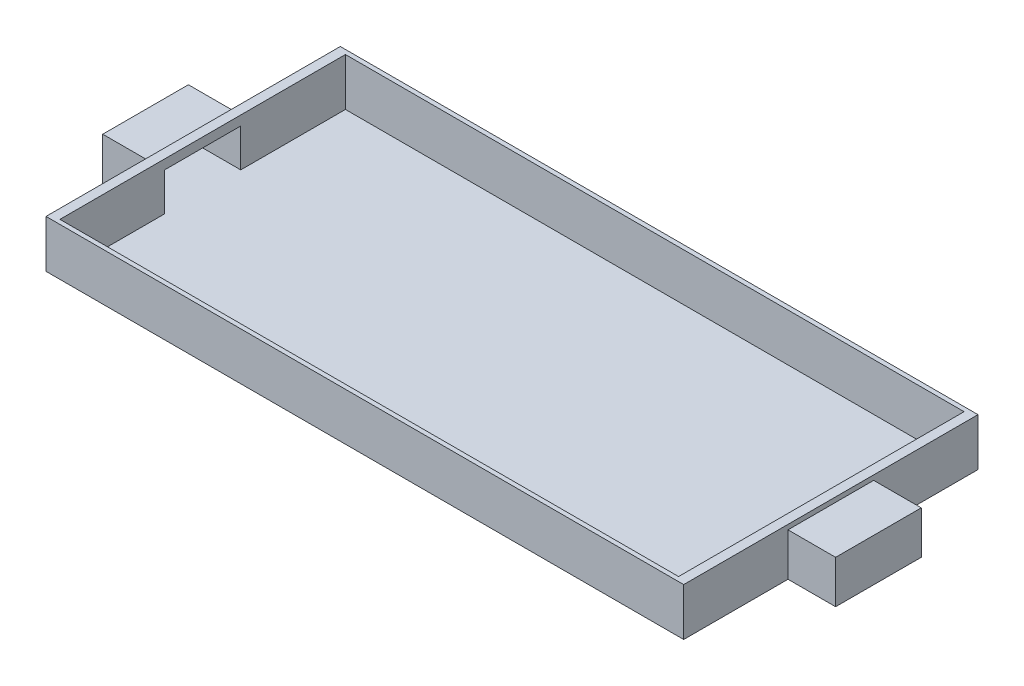
ISO-10303-21;
HEADER;
FILE_DESCRIPTION(('STEP AP214'),'2;1');
FILE_NAME('part.step','',(''),(''),'','','');
FILE_SCHEMA(('AUTOMOTIVE_DESIGN { 1 0 10303 214 1 1 1 1 }'));
ENDSEC;
DATA;
#1=APPLICATION_CONTEXT('core data for automotive mechanical design processes');
#2=APPLICATION_PROTOCOL_DEFINITION('international standard','automotive_design',2000,#1);
#3=PRODUCT_CONTEXT('',#1,'mechanical');
#4=PRODUCT('Part','Part','',(#3));
#5=PRODUCT_RELATED_PRODUCT_CATEGORY('part','',(#4));
#6=PRODUCT_DEFINITION_FORMATION('','',#4);
#7=PRODUCT_DEFINITION_CONTEXT('part definition',#1,'design');
#8=PRODUCT_DEFINITION('design','',#6,#7);
#9=PRODUCT_DEFINITION_SHAPE('','',#8);
#10=(LENGTH_UNIT() NAMED_UNIT(*) SI_UNIT(.MILLI.,.METRE.));
#11=(NAMED_UNIT(*) PLANE_ANGLE_UNIT() SI_UNIT($,.RADIAN.));
#12=(NAMED_UNIT(*) SI_UNIT($,.STERADIAN.) SOLID_ANGLE_UNIT());
#13=UNCERTAINTY_MEASURE_WITH_UNIT(LENGTH_MEASURE(1.E-05),#10,'distance_accuracy_value','');
#14=(GEOMETRIC_REPRESENTATION_CONTEXT(3) GLOBAL_UNCERTAINTY_ASSIGNED_CONTEXT((#13)) GLOBAL_UNIT_ASSIGNED_CONTEXT((#10,
#11,#12)) REPRESENTATION_CONTEXT('',''));
#15=CARTESIAN_POINT('',(0.,0.,0.));
#16=DIRECTION('',(0.,0.,1.));
#17=DIRECTION('',(1.,0.,0.));
#18=AXIS2_PLACEMENT_3D('',#15,#16,#17);
#19=CARTESIAN_POINT('',(0.,0.,0.));
#20=DIRECTION('',(0.,1.,0.));
#21=DIRECTION('',(0.,0.,1.));
#22=AXIS2_PLACEMENT_3D('',#19,#20,#21);
#23=PLANE('',#22);
#24=DIRECTION('',(-1.,0.,0.));
#25=VECTOR('',#24,1.);
#26=CARTESIAN_POINT('',(-3.25,0.,-1.5));
#27=LINE('',#26,#25);
#28=CARTESIAN_POINT('',(3.25,0.,-1.5));
#29=VERTEX_POINT('',#28);
#30=CARTESIAN_POINT('',(-3.25,0.,-1.5));
#31=VERTEX_POINT('',#30);
#32=EDGE_CURVE('E90',#29,#31,#27,.T.);
#33=ORIENTED_EDGE('',*,*,#32,.F.);
#34=DIRECTION('',(0.,0.,-1.));
#35=VECTOR('',#34,1.);
#36=CARTESIAN_POINT('',(3.25,0.,-1.5));
#37=LINE('',#36,#35);
#38=CARTESIAN_POINT('',(3.25,0.,-0.399999999999998));
#39=VERTEX_POINT('',#38);
#40=EDGE_CURVE('E12',#39,#29,#37,.T.);
#41=ORIENTED_EDGE('',*,*,#40,.F.);
#42=DIRECTION('',(1.,0.,0.));
#43=VECTOR('',#42,1.);
#44=CARTESIAN_POINT('',(-3.350012,0.,-0.400000000000002));
#45=LINE('',#44,#43);
#46=CARTESIAN_POINT('',(3.8,0.,-0.400000000000002));
#47=VERTEX_POINT('',#46);
#48=EDGE_CURVE('E50',#39,#47,#45,.T.);
#49=ORIENTED_EDGE('',*,*,#48,.T.);
#50=DIRECTION('',(0.,0.,-1.));
#51=VECTOR('',#50,1.);
#52=CARTESIAN_POINT('',(3.8,0.,0.399999999999998));
#53=LINE('',#52,#51);
#54=CARTESIAN_POINT('',(3.8,0.,0.399999999999998));
#55=VERTEX_POINT('',#54);
#56=EDGE_CURVE('E120',#55,#47,#53,.T.);
#57=ORIENTED_EDGE('',*,*,#56,.F.);
#58=DIRECTION('',(1.,0.,0.));
#59=VECTOR('',#58,1.);
#60=CARTESIAN_POINT('',(-3.350012,0.,0.399999999999998));
#61=LINE('',#60,#59);
#62=CARTESIAN_POINT('',(3.25,0.,0.400000000000002));
#63=VERTEX_POINT('',#62);
#64=EDGE_CURVE('E117',#63,#55,#61,.T.);
#65=ORIENTED_EDGE('',*,*,#64,.F.);
#66=DIRECTION('',(0.,0.,-1.));
#67=VECTOR('',#66,1.);
#68=CARTESIAN_POINT('',(3.25,0.,-1.5));
#69=LINE('',#68,#67);
#70=CARTESIAN_POINT('',(3.25,0.,1.5));
#71=VERTEX_POINT('',#70);
#72=EDGE_CURVE('E114',#71,#63,#69,.T.);
#73=ORIENTED_EDGE('',*,*,#72,.F.);
#74=DIRECTION('',(1.,0.,0.));
#75=VECTOR('',#74,1.);
#76=CARTESIAN_POINT('',(-3.25,0.,1.5));
#77=LINE('',#76,#75);
#78=CARTESIAN_POINT('',(-3.25,0.,1.5));
#79=VERTEX_POINT('',#78);
#80=EDGE_CURVE('E111',#79,#71,#77,.T.);
#81=ORIENTED_EDGE('',*,*,#80,.F.);
#82=DIRECTION('',(0.,0.,1.));
#83=VECTOR('',#82,1.);
#84=CARTESIAN_POINT('',(-3.25,0.,-1.5));
#85=LINE('',#84,#83);
#86=CARTESIAN_POINT('',(-3.25,0.,0.399999999999998));
#87=VERTEX_POINT('',#86);
#88=EDGE_CURVE('E108',#87,#79,#85,.T.);
#89=ORIENTED_EDGE('',*,*,#88,.F.);
#90=DIRECTION('',(1.,0.,0.));
#91=VECTOR('',#90,1.);
#92=CARTESIAN_POINT('',(-3.350012,0.,0.399999999999998));
#93=LINE('',#92,#91);
#94=CARTESIAN_POINT('',(-3.8,0.,0.399999999999998));
#95=VERTEX_POINT('',#94);
#96=EDGE_CURVE('E105',#95,#87,#93,.T.);
#97=ORIENTED_EDGE('',*,*,#96,.F.);
#98=DIRECTION('',(0.,0.,-1.));
#99=VECTOR('',#98,1.);
#100=CARTESIAN_POINT('',(-3.8,0.,0.399999999999998));
#101=LINE('',#100,#99);
#102=CARTESIAN_POINT('',(-3.8,0.,-0.400000000000002));
#103=VERTEX_POINT('',#102);
#104=EDGE_CURVE('E102',#95,#103,#101,.T.);
#105=ORIENTED_EDGE('',*,*,#104,.T.);
#106=DIRECTION('',(1.,0.,0.));
#107=VECTOR('',#106,1.);
#108=CARTESIAN_POINT('',(-3.350012,0.,-0.400000000000002));
#109=LINE('',#108,#107);
#110=CARTESIAN_POINT('',(-3.25,0.,-0.400000000000002));
#111=VERTEX_POINT('',#110);
#112=EDGE_CURVE('E92',#103,#111,#109,.T.);
#113=ORIENTED_EDGE('',*,*,#112,.T.);
#114=DIRECTION('',(0.,0.,1.));
#115=VECTOR('',#114,1.);
#116=CARTESIAN_POINT('',(-3.25,0.,-1.5));
#117=LINE('',#116,#115);
#118=EDGE_CURVE('E88',#31,#111,#117,.T.);
#119=ORIENTED_EDGE('',*,*,#118,.F.);
#120=EDGE_LOOP('',(#33,#41,#49,#57,#65,#73,#81,#89,#97,#105,#113,#119));
#121=FACE_BOUND('',#120,.T.);
#122=ADVANCED_FACE('F45',(#121),#23,.F.);
#123=OPEN_SHELL('',(#122));
#124=SHELL_BASED_SURFACE_MODEL('B2',(#123));
#125=CARTESIAN_POINT('',(0.,0.,0.));
#126=DIRECTION('',(0.,1.,0.));
#127=DIRECTION('',(0.,0.,1.));
#128=AXIS2_PLACEMENT_3D('',#125,#126,#127);
#129=PLANE('',#128);
#130=DIRECTION('',(0.,0.,-1.));
#131=VECTOR('',#130,1.);
#132=CARTESIAN_POINT('',(3.35,0.,-1.54615384615385));
#133=LINE('',#132,#131);
#134=CARTESIAN_POINT('',(3.35,0.,-0.450000000000002));
#135=VERTEX_POINT('',#134);
#136=CARTESIAN_POINT('',(3.35,0.,-1.54615384615385));
#137=VERTEX_POINT('',#136);
#138=EDGE_CURVE('E466',#135,#137,#133,.T.);
#139=ORIENTED_EDGE('',*,*,#138,.F.);
#140=DIRECTION('',(-1.,0.,0.));
#141=VECTOR('',#140,1.);
#142=CARTESIAN_POINT('',(3.85,0.,-0.450000000000002));
#143=LINE('',#142,#141);
#144=CARTESIAN_POINT('',(3.85,0.,-0.450000000000002));
#145=VERTEX_POINT('',#144);
#146=EDGE_CURVE('E176',#145,#135,#143,.T.);
#147=ORIENTED_EDGE('',*,*,#146,.F.);
#148=DIRECTION('',(0.,0.,1.));
#149=VECTOR('',#148,1.);
#150=CARTESIAN_POINT('',(3.85,0.,0.449999999999998));
#151=LINE('',#150,#149);
#152=CARTESIAN_POINT('',(3.85,0.,0.449999999999998));
#153=VERTEX_POINT('',#152);
#154=EDGE_CURVE('E355',#145,#153,#151,.T.);
#155=ORIENTED_EDGE('',*,*,#154,.T.);
#156=DIRECTION('',(-1.,0.,0.));
#157=VECTOR('',#156,1.);
#158=CARTESIAN_POINT('',(3.85,0.,0.449999999999998));
#159=LINE('',#158,#157);
#160=CARTESIAN_POINT('',(3.35,0.,0.449999999999998));
#161=VERTEX_POINT('',#160);
#162=EDGE_CURVE('E367',#153,#161,#159,.T.);
#163=ORIENTED_EDGE('',*,*,#162,.T.);
#164=CARTESIAN_POINT('',(3.35,0.,1.54615384615384));
#165=VERTEX_POINT('',#164);
#166=EDGE_CURVE('E478',#165,#161,#133,.T.);
#167=ORIENTED_EDGE('',*,*,#166,.F.);
#168=DIRECTION('',(1.,0.,0.));
#169=VECTOR('',#168,1.);
#170=CARTESIAN_POINT('',(-3.35,0.,1.54615384615384));
#171=LINE('',#170,#169);
#172=CARTESIAN_POINT('',(-3.35,0.,1.54615384615384));
#173=VERTEX_POINT('',#172);
#174=EDGE_CURVE('E471',#173,#165,#171,.T.);
#175=ORIENTED_EDGE('',*,*,#174,.F.);
#176=DIRECTION('',(0.,0.,1.));
#177=VECTOR('',#176,1.);
#178=CARTESIAN_POINT('',(-3.35,0.,-1.54615384615385));
#179=LINE('',#178,#177);
#180=CARTESIAN_POINT('',(-3.35,0.,0.449999999999998));
#181=VERTEX_POINT('',#180);
#182=EDGE_CURVE('E483',#181,#173,#179,.T.);
#183=ORIENTED_EDGE('',*,*,#182,.F.);
#184=DIRECTION('',(1.,0.,0.));
#185=VECTOR('',#184,1.);
#186=CARTESIAN_POINT('',(-3.85,0.,0.449999999999998));
#187=LINE('',#186,#185);
#188=CARTESIAN_POINT('',(-3.85,0.,0.449999999999998));
#189=VERTEX_POINT('',#188);
#190=EDGE_CURVE('E416',#189,#181,#187,.T.);
#191=ORIENTED_EDGE('',*,*,#190,.F.);
#192=DIRECTION('',(0.,0.,1.));
#193=VECTOR('',#192,1.);
#194=CARTESIAN_POINT('',(-3.85,0.,0.449999999999998));
#195=LINE('',#194,#193);
#196=CARTESIAN_POINT('',(-3.85,0.,-0.450000000000002));
#197=VERTEX_POINT('',#196);
#198=EDGE_CURVE('E393',#197,#189,#195,.T.);
#199=ORIENTED_EDGE('',*,*,#198,.F.);
#200=DIRECTION('',(1.,0.,0.));
#201=VECTOR('',#200,1.);
#202=CARTESIAN_POINT('',(-3.85,0.,-0.450000000000002));
#203=LINE('',#202,#201);
#204=CARTESIAN_POINT('',(-3.35,0.,-0.450000000000002));
#205=VERTEX_POINT('',#204);
#206=EDGE_CURVE('E402',#197,#205,#203,.T.);
#207=ORIENTED_EDGE('',*,*,#206,.T.);
#208=CARTESIAN_POINT('',(-3.35,0.,-1.54615384615385));
#209=VERTEX_POINT('',#208);
#210=EDGE_CURVE('E484',#209,#205,#179,.T.);
#211=ORIENTED_EDGE('',*,*,#210,.F.);
#212=DIRECTION('',(-1.,0.,0.));
#213=VECTOR('',#212,1.);
#214=CARTESIAN_POINT('',(-3.35,0.,-1.54615384615385));
#215=LINE('',#214,#213);
#216=EDGE_CURVE('E481',#137,#209,#215,.T.);
#217=ORIENTED_EDGE('',*,*,#216,.F.);
#218=EDGE_LOOP('',(#139,#147,#155,#163,#167,#175,#183,#191,#199,#207,#211,#217));
#219=FACE_BOUND('',#218,.T.);
#220=DIRECTION('',(1.,0.,0.));
#221=VECTOR('',#220,1.);
#222=CARTESIAN_POINT('',(-3.350012,0.,0.399999999999998));
#223=LINE('',#222,#221);
#224=CARTESIAN_POINT('',(3.25,0.,0.400000000000002));
#225=VERTEX_POINT('',#224);
#226=CARTESIAN_POINT('',(3.8,0.,0.399999999999998));
#227=VERTEX_POINT('',#226);
#228=EDGE_CURVE('E419',#225,#227,#223,.T.);
#229=ORIENTED_EDGE('',*,*,#228,.T.);
#230=DIRECTION('',(0.,0.,-1.));
#231=VECTOR('',#230,1.);
#232=CARTESIAN_POINT('',(3.8,0.,0.399999999999998));
#233=LINE('',#232,#231);
#234=CARTESIAN_POINT('',(3.8,0.,-0.400000000000002));
#235=VERTEX_POINT('',#234);
#236=EDGE_CURVE('E344',#227,#235,#233,.T.);
#237=ORIENTED_EDGE('',*,*,#236,.T.);
#238=DIRECTION('',(1.,0.,0.));
#239=VECTOR('',#238,1.);
#240=CARTESIAN_POINT('',(-3.350012,0.,-0.400000000000002));
#241=LINE('',#240,#239);
#242=CARTESIAN_POINT('',(3.25,0.,-0.399999999999998));
#243=VERTEX_POINT('',#242);
#244=EDGE_CURVE('E340',#243,#235,#241,.T.);
#245=ORIENTED_EDGE('',*,*,#244,.F.);
#246=DIRECTION('',(0.,0.,-1.));
#247=VECTOR('',#246,1.);
#248=CARTESIAN_POINT('',(3.25,0.,-1.5));
#249=LINE('',#248,#247);
#250=CARTESIAN_POINT('',(3.25,0.,-1.5));
#251=VERTEX_POINT('',#250);
#252=EDGE_CURVE('E432',#243,#251,#249,.T.);
#253=ORIENTED_EDGE('',*,*,#252,.T.);
#254=DIRECTION('',(-1.,0.,0.));
#255=VECTOR('',#254,1.);
#256=CARTESIAN_POINT('',(-3.25,0.,-1.5));
#257=LINE('',#256,#255);
#258=CARTESIAN_POINT('',(-3.25,0.,-1.5));
#259=VERTEX_POINT('',#258);
#260=EDGE_CURVE('E447',#251,#259,#257,.T.);
#261=ORIENTED_EDGE('',*,*,#260,.T.);
#262=DIRECTION('',(0.,0.,1.));
#263=VECTOR('',#262,1.);
#264=CARTESIAN_POINT('',(-3.25,0.,-1.5));
#265=LINE('',#264,#263);
#266=CARTESIAN_POINT('',(-3.25,0.,-0.400000000000002));
#267=VERTEX_POINT('',#266);
#268=EDGE_CURVE('E451',#259,#267,#265,.T.);
#269=ORIENTED_EDGE('',*,*,#268,.T.);
#270=CARTESIAN_POINT('',(-3.8,0.,-0.400000000000002));
#271=VERTEX_POINT('',#270);
#272=EDGE_CURVE('E334',#271,#267,#241,.T.);
#273=ORIENTED_EDGE('',*,*,#272,.F.);
#274=DIRECTION('',(0.,0.,-1.));
#275=VECTOR('',#274,1.);
#276=CARTESIAN_POINT('',(-3.8,0.,0.399999999999998));
#277=LINE('',#276,#275);
#278=CARTESIAN_POINT('',(-3.8,0.,0.399999999999998));
#279=VERTEX_POINT('',#278);
#280=EDGE_CURVE('E386',#279,#271,#277,.T.);
#281=ORIENTED_EDGE('',*,*,#280,.F.);
#282=CARTESIAN_POINT('',(-3.25,0.,0.399999999999998));
#283=VERTEX_POINT('',#282);
#284=EDGE_CURVE('E421',#279,#283,#223,.T.);
#285=ORIENTED_EDGE('',*,*,#284,.T.);
#286=CARTESIAN_POINT('',(-3.25,0.,1.5));
#287=VERTEX_POINT('',#286);
#288=EDGE_CURVE('E450',#283,#287,#265,.T.);
#289=ORIENTED_EDGE('',*,*,#288,.T.);
#290=DIRECTION('',(1.,0.,0.));
#291=VECTOR('',#290,1.);
#292=CARTESIAN_POINT('',(-3.25,0.,1.5));
#293=LINE('',#292,#291);
#294=CARTESIAN_POINT('',(3.25,0.,1.5));
#295=VERTEX_POINT('',#294);
#296=EDGE_CURVE('E436',#287,#295,#293,.T.);
#297=ORIENTED_EDGE('',*,*,#296,.T.);
#298=EDGE_CURVE('E444',#295,#225,#249,.T.);
#299=ORIENTED_EDGE('',*,*,#298,.T.);
#300=EDGE_LOOP('',(#229,#237,#245,#253,#261,#269,#273,#281,#285,#289,#297,#299));
#301=FACE_BOUND('',#300,.T.);
#302=ADVANCED_FACE('F161',(#219,#301),#129,.F.);
#303=CARTESIAN_POINT('',(-3.35,0.5,-1.54615384615385));
#304=DIRECTION('',(1.,0.,0.));
#305=DIRECTION('',(0.,0.,-1.));
#306=AXIS2_PLACEMENT_3D('',#303,#304,#305);
#307=PLANE('',#306);
#308=DIRECTION('',(0.,-1.,0.));
#309=VECTOR('',#308,1.);
#310=CARTESIAN_POINT('',(-3.35,0.,-0.450000000000002));
#311=LINE('',#310,#309);
#312=CARTESIAN_POINT('',(-3.35,0.45,-0.450000000000002));
#313=VERTEX_POINT('',#312);
#314=EDGE_CURVE('E184',#313,#205,#311,.T.);
#315=ORIENTED_EDGE('',*,*,#314,.F.);
#316=DIRECTION('',(0.,0.,-1.));
#317=VECTOR('',#316,1.);
#318=CARTESIAN_POINT('',(-3.35,0.45,-0.450000000000002));
#319=LINE('',#318,#317);
#320=CARTESIAN_POINT('',(-3.35,0.45,0.449999999999998));
#321=VERTEX_POINT('',#320);
#322=EDGE_CURVE('E405',#321,#313,#319,.T.);
#323=ORIENTED_EDGE('',*,*,#322,.F.);
#324=DIRECTION('',(0.,1.,0.));
#325=VECTOR('',#324,1.);
#326=CARTESIAN_POINT('',(-3.35,0.45,0.449999999999998));
#327=LINE('',#326,#325);
#328=EDGE_CURVE('E392',#181,#321,#327,.T.);
#329=ORIENTED_EDGE('',*,*,#328,.F.);
#330=ORIENTED_EDGE('',*,*,#182,.T.);
#331=DIRECTION('',(0.,-1.,0.));
#332=VECTOR('',#331,1.);
#333=CARTESIAN_POINT('',(-3.35,0.5,1.54615384615384));
#334=LINE('',#333,#332);
#335=CARTESIAN_POINT('',(-3.35,0.5,1.54615384615384));
#336=VERTEX_POINT('',#335);
#337=EDGE_CURVE('E489',#336,#173,#334,.T.);
#338=ORIENTED_EDGE('',*,*,#337,.F.);
#339=DIRECTION('',(0.,0.,1.));
#340=VECTOR('',#339,1.);
#341=CARTESIAN_POINT('',(-3.35,0.5,-1.54615384615385));
#342=LINE('',#341,#340);
#343=CARTESIAN_POINT('',(-3.35,0.5,-1.54615384615385));
#344=VERTEX_POINT('',#343);
#345=EDGE_CURVE('E473',#344,#336,#342,.T.);
#346=ORIENTED_EDGE('',*,*,#345,.F.);
#347=DIRECTION('',(0.,-1.,0.));
#348=VECTOR('',#347,1.);
#349=CARTESIAN_POINT('',(-3.35,0.5,-1.54615384615385));
#350=LINE('',#349,#348);
#351=EDGE_CURVE('E492',#344,#209,#350,.T.);
#352=ORIENTED_EDGE('',*,*,#351,.T.);
#353=ORIENTED_EDGE('',*,*,#210,.T.);
#354=EDGE_LOOP('',(#315,#323,#329,#330,#338,#346,#352,#353));
#355=FACE_BOUND('',#354,.T.);
#356=ADVANCED_FACE('F555',(#355),#307,.F.);
#357=CARTESIAN_POINT('',(3.35,0.5,-1.54615384615385));
#358=DIRECTION('',(-1.,0.,0.));
#359=DIRECTION('',(0.,0.,1.));
#360=AXIS2_PLACEMENT_3D('',#357,#358,#359);
#361=PLANE('',#360);
#362=ORIENTED_EDGE('',*,*,#166,.T.);
#363=DIRECTION('',(0.,1.,0.));
#364=VECTOR('',#363,1.);
#365=CARTESIAN_POINT('',(3.35,0.45,0.449999999999998));
#366=LINE('',#365,#364);
#367=CARTESIAN_POINT('',(3.35,0.45,0.449999999999998));
#368=VERTEX_POINT('',#367);
#369=EDGE_CURVE('E359',#161,#368,#366,.T.);
#370=ORIENTED_EDGE('',*,*,#369,.T.);
#371=DIRECTION('',(0.,0.,-1.));
#372=VECTOR('',#371,1.);
#373=CARTESIAN_POINT('',(3.35,0.45,-0.450000000000002));
#374=LINE('',#373,#372);
#375=CARTESIAN_POINT('',(3.35,0.45,-0.450000000000002));
#376=VERTEX_POINT('',#375);
#377=EDGE_CURVE('E369',#368,#376,#374,.T.);
#378=ORIENTED_EDGE('',*,*,#377,.T.);
#379=DIRECTION('',(0.,-1.,0.));
#380=VECTOR('',#379,1.);
#381=CARTESIAN_POINT('',(3.35,0.,-0.450000000000002));
#382=LINE('',#381,#380);
#383=EDGE_CURVE('E354',#376,#135,#382,.T.);
#384=ORIENTED_EDGE('',*,*,#383,.T.);
#385=ORIENTED_EDGE('',*,*,#138,.T.);
#386=DIRECTION('',(0.,-1.,0.));
#387=VECTOR('',#386,1.);
#388=CARTESIAN_POINT('',(3.35,0.5,-1.54615384615385));
#389=LINE('',#388,#387);
#390=CARTESIAN_POINT('',(3.35,0.5,-1.54615384615385));
#391=VERTEX_POINT('',#390);
#392=EDGE_CURVE('E495',#391,#137,#389,.T.);
#393=ORIENTED_EDGE('',*,*,#392,.F.);
#394=DIRECTION('',(0.,0.,-1.));
#395=VECTOR('',#394,1.);
#396=CARTESIAN_POINT('',(3.35,0.5,-1.54615384615385));
#397=LINE('',#396,#395);
#398=CARTESIAN_POINT('',(3.35,0.5,1.54615384615384));
#399=VERTEX_POINT('',#398);
#400=EDGE_CURVE('E467',#399,#391,#397,.T.);
#401=ORIENTED_EDGE('',*,*,#400,.F.);
#402=DIRECTION('',(0.,-1.,0.));
#403=VECTOR('',#402,1.);
#404=CARTESIAN_POINT('',(3.35,0.5,1.54615384615384));
#405=LINE('',#404,#403);
#406=EDGE_CURVE('E477',#399,#165,#405,.T.);
#407=ORIENTED_EDGE('',*,*,#406,.T.);
#408=EDGE_LOOP('',(#362,#370,#378,#384,#385,#393,#401,#407));
#409=FACE_BOUND('',#408,.T.);
#410=ADVANCED_FACE('F163',(#409),#361,.F.);
#411=CARTESIAN_POINT('',(3.25,0.5,-1.5));
#412=DIRECTION('',(-1.,0.,0.));
#413=DIRECTION('',(0.,0.,1.));
#414=AXIS2_PLACEMENT_3D('',#411,#412,#413);
#415=PLANE('',#414);
#416=DIRECTION('',(0.,0.,1.));
#417=VECTOR('',#416,1.);
#418=CARTESIAN_POINT('',(3.25,0.4,-1.5));
#419=LINE('',#418,#417);
#420=CARTESIAN_POINT('',(3.25,0.4,-0.399999999999998));
#421=VERTEX_POINT('',#420);
#422=CARTESIAN_POINT('',(3.25,0.4,0.400000000000002));
#423=VERTEX_POINT('',#422);
#424=EDGE_CURVE('E330',#421,#423,#419,.T.);
#425=ORIENTED_EDGE('',*,*,#424,.T.);
#426=DIRECTION('',(0.,-1.,0.));
#427=VECTOR('',#426,1.);
#428=CARTESIAN_POINT('',(3.25,0.500000000000001,0.400000000000002));
#429=LINE('',#428,#427);
#430=EDGE_CURVE('E429',#423,#225,#429,.T.);
#431=ORIENTED_EDGE('',*,*,#430,.T.);
#432=ORIENTED_EDGE('',*,*,#298,.F.);
#433=DIRECTION('',(0.,-1.,0.));
#434=VECTOR('',#433,1.);
#435=CARTESIAN_POINT('',(3.25,0.5,1.5));
#436=LINE('',#435,#434);
#437=CARTESIAN_POINT('',(3.25,0.5,1.5));
#438=VERTEX_POINT('',#437);
#439=EDGE_CURVE('E443',#438,#295,#436,.T.);
#440=ORIENTED_EDGE('',*,*,#439,.F.);
#441=DIRECTION('',(0.,0.,-1.));
#442=VECTOR('',#441,1.);
#443=CARTESIAN_POINT('',(3.25,0.5,-1.5));
#444=LINE('',#443,#442);
#445=CARTESIAN_POINT('',(3.25,0.5,-1.5));
#446=VERTEX_POINT('',#445);
#447=EDGE_CURVE('E433',#438,#446,#444,.T.);
#448=ORIENTED_EDGE('',*,*,#447,.T.);
#449=DIRECTION('',(0.,-1.,0.));
#450=VECTOR('',#449,1.);
#451=CARTESIAN_POINT('',(3.25,0.5,-1.5));
#452=LINE('',#451,#450);
#453=EDGE_CURVE('E463',#446,#251,#452,.T.);
#454=ORIENTED_EDGE('',*,*,#453,.T.);
#455=ORIENTED_EDGE('',*,*,#252,.F.);
#456=DIRECTION('',(0.,1.,0.));
#457=VECTOR('',#456,1.);
#458=CARTESIAN_POINT('',(3.25,0.5,-0.399999999999998));
#459=LINE('',#458,#457);
#460=EDGE_CURVE('E426',#243,#421,#459,.T.);
#461=ORIENTED_EDGE('',*,*,#460,.T.);
#462=EDGE_LOOP('',(#425,#431,#432,#440,#448,#454,#455,#461));
#463=FACE_BOUND('',#462,.T.);
#464=ADVANCED_FACE('F535',(#463),#415,.T.);
#465=CARTESIAN_POINT('',(-3.25,0.5,-1.5));
#466=DIRECTION('',(1.,0.,0.));
#467=DIRECTION('',(0.,0.,-1.));
#468=AXIS2_PLACEMENT_3D('',#465,#466,#467);
#469=PLANE('',#468);
#470=ORIENTED_EDGE('',*,*,#288,.F.);
#471=DIRECTION('',(0.,1.,0.));
#472=VECTOR('',#471,1.);
#473=CARTESIAN_POINT('',(-3.25,0.500000000000001,0.399999999999998));
#474=LINE('',#473,#472);
#475=CARTESIAN_POINT('',(-3.25,0.4,0.399999999999998));
#476=VERTEX_POINT('',#475);
#477=EDGE_CURVE('E43',#283,#476,#474,.T.);
#478=ORIENTED_EDGE('',*,*,#477,.T.);
#479=DIRECTION('',(0.,0.,-1.));
#480=VECTOR('',#479,1.);
#481=CARTESIAN_POINT('',(-3.25,0.4,-1.5));
#482=LINE('',#481,#480);
#483=CARTESIAN_POINT('',(-3.25,0.4,-0.400000000000002));
#484=VERTEX_POINT('',#483);
#485=EDGE_CURVE('E169',#476,#484,#482,.T.);
#486=ORIENTED_EDGE('',*,*,#485,.T.);
#487=DIRECTION('',(0.,-1.,0.));
#488=VECTOR('',#487,1.);
#489=CARTESIAN_POINT('',(-3.25,0.5,-0.400000000000002));
#490=LINE('',#489,#488);
#491=EDGE_CURVE('E498',#484,#267,#490,.T.);
#492=ORIENTED_EDGE('',*,*,#491,.T.);
#493=ORIENTED_EDGE('',*,*,#268,.F.);
#494=DIRECTION('',(0.,-1.,0.));
#495=VECTOR('',#494,1.);
#496=CARTESIAN_POINT('',(-3.25,0.5,-1.5));
#497=LINE('',#496,#495);
#498=CARTESIAN_POINT('',(-3.25,0.5,-1.5));
#499=VERTEX_POINT('',#498);
#500=EDGE_CURVE('E461',#499,#259,#497,.T.);
#501=ORIENTED_EDGE('',*,*,#500,.F.);
#502=DIRECTION('',(0.,0.,1.));
#503=VECTOR('',#502,1.);
#504=CARTESIAN_POINT('',(-3.25,0.5,-1.5));
#505=LINE('',#504,#503);
#506=CARTESIAN_POINT('',(-3.25,0.5,1.5));
#507=VERTEX_POINT('',#506);
#508=EDGE_CURVE('E438',#499,#507,#505,.T.);
#509=ORIENTED_EDGE('',*,*,#508,.T.);
#510=DIRECTION('',(0.,-1.,0.));
#511=VECTOR('',#510,1.);
#512=CARTESIAN_POINT('',(-3.25,0.5,1.5));
#513=LINE('',#512,#511);
#514=EDGE_CURVE('E458',#507,#287,#513,.T.);
#515=ORIENTED_EDGE('',*,*,#514,.T.);
#516=EDGE_LOOP('',(#470,#478,#486,#492,#493,#501,#509,#515));
#517=FACE_BOUND('',#516,.T.);
#518=ADVANCED_FACE('F503',(#517),#469,.T.);
#519=CARTESIAN_POINT('',(0.,0.5,0.));
#520=DIRECTION('',(0.,1.,0.));
#521=DIRECTION('',(0.,0.,1.));
#522=AXIS2_PLACEMENT_3D('',#519,#520,#521);
#523=PLANE('',#522);
#524=ORIENTED_EDGE('',*,*,#400,.T.);
#525=DIRECTION('',(-1.,0.,0.));
#526=VECTOR('',#525,1.);
#527=CARTESIAN_POINT('',(-3.35,0.5,-1.54615384615385));
#528=LINE('',#527,#526);
#529=EDGE_CURVE('E470',#391,#344,#528,.T.);
#530=ORIENTED_EDGE('',*,*,#529,.T.);
#531=ORIENTED_EDGE('',*,*,#345,.T.);
#532=DIRECTION('',(1.,0.,0.));
#533=VECTOR('',#532,1.);
#534=CARTESIAN_POINT('',(-3.35,0.5,1.54615384615384));
#535=LINE('',#534,#533);
#536=EDGE_CURVE('E475',#336,#399,#535,.T.);
#537=ORIENTED_EDGE('',*,*,#536,.T.);
#538=EDGE_LOOP('',(#524,#530,#531,#537));
#539=FACE_BOUND('',#538,.T.);
#540=DIRECTION('',(-1.,0.,0.));
#541=VECTOR('',#540,1.);
#542=CARTESIAN_POINT('',(-3.25,0.5,-1.5));
#543=LINE('',#542,#541);
#544=EDGE_CURVE('E435',#446,#499,#543,.T.);
#545=ORIENTED_EDGE('',*,*,#544,.F.);
#546=ORIENTED_EDGE('',*,*,#447,.F.);
#547=DIRECTION('',(1.,0.,0.));
#548=VECTOR('',#547,1.);
#549=CARTESIAN_POINT('',(-3.25,0.5,1.5));
#550=LINE('',#549,#548);
#551=EDGE_CURVE('E441',#507,#438,#550,.T.);
#552=ORIENTED_EDGE('',*,*,#551,.F.);
#553=ORIENTED_EDGE('',*,*,#508,.F.);
#554=EDGE_LOOP('',(#545,#546,#552,#553));
#555=FACE_BOUND('',#554,.T.);
#556=ADVANCED_FACE('F528',(#539,#555),#523,.T.);
#557=CARTESIAN_POINT('',(-3.35,0.5,-1.54615384615385));
#558=DIRECTION('',(0.,0.,1.));
#559=DIRECTION('',(1.,0.,0.));
#560=AXIS2_PLACEMENT_3D('',#557,#558,#559);
#561=PLANE('',#560);
#562=ORIENTED_EDGE('',*,*,#216,.T.);
#563=ORIENTED_EDGE('',*,*,#351,.F.);
#564=ORIENTED_EDGE('',*,*,#529,.F.);
#565=ORIENTED_EDGE('',*,*,#392,.T.);
#566=EDGE_LOOP('',(#562,#563,#564,#565));
#567=FACE_BOUND('',#566,.T.);
#568=ADVANCED_FACE('F549',(#567),#561,.F.);
#569=CARTESIAN_POINT('',(-3.35,0.5,1.54615384615384));
#570=DIRECTION('',(0.,0.,-1.));
#571=DIRECTION('',(-1.,0.,0.));
#572=AXIS2_PLACEMENT_3D('',#569,#570,#571);
#573=PLANE('',#572);
#574=ORIENTED_EDGE('',*,*,#174,.T.);
#575=ORIENTED_EDGE('',*,*,#406,.F.);
#576=ORIENTED_EDGE('',*,*,#536,.F.);
#577=ORIENTED_EDGE('',*,*,#337,.T.);
#578=EDGE_LOOP('',(#574,#575,#576,#577));
#579=FACE_BOUND('',#578,.T.);
#580=ADVANCED_FACE('F542',(#579),#573,.F.);
#581=CARTESIAN_POINT('',(-3.25,0.5,-1.5));
#582=DIRECTION('',(0.,0.,1.));
#583=DIRECTION('',(1.,0.,0.));
#584=AXIS2_PLACEMENT_3D('',#581,#582,#583);
#585=PLANE('',#584);
#586=ORIENTED_EDGE('',*,*,#260,.F.);
#587=ORIENTED_EDGE('',*,*,#453,.F.);
#588=ORIENTED_EDGE('',*,*,#544,.T.);
#589=ORIENTED_EDGE('',*,*,#500,.T.);
#590=EDGE_LOOP('',(#586,#587,#588,#589));
#591=FACE_BOUND('',#590,.T.);
#592=ADVANCED_FACE('F540',(#591),#585,.T.);
#593=CARTESIAN_POINT('',(-3.25,0.5,1.5));
#594=DIRECTION('',(0.,0.,-1.));
#595=DIRECTION('',(-1.,0.,0.));
#596=AXIS2_PLACEMENT_3D('',#593,#594,#595);
#597=PLANE('',#596);
#598=ORIENTED_EDGE('',*,*,#296,.F.);
#599=ORIENTED_EDGE('',*,*,#514,.F.);
#600=ORIENTED_EDGE('',*,*,#551,.T.);
#601=ORIENTED_EDGE('',*,*,#439,.T.);
#602=EDGE_LOOP('',(#598,#599,#600,#601));
#603=FACE_BOUND('',#602,.T.);
#604=ADVANCED_FACE('F533',(#603),#597,.T.);
#605=CARTESIAN_POINT('',(-3.350012,0.4,-0.400000000000002));
#606=DIRECTION('',(0.,0.,1.));
#607=DIRECTION('',(1.,0.,0.));
#608=AXIS2_PLACEMENT_3D('',#605,#606,#607);
#609=PLANE('',#608);
#610=DIRECTION('',(1.,0.,0.));
#611=VECTOR('',#610,1.);
#612=CARTESIAN_POINT('',(-3.350012,0.4,-0.400000000000002));
#613=LINE('',#612,#611);
#614=CARTESIAN_POINT('',(-3.8,0.4,-0.400000000000002));
#615=VERTEX_POINT('',#614);
#616=EDGE_CURVE('E333',#615,#484,#613,.T.);
#617=ORIENTED_EDGE('',*,*,#616,.F.);
#618=DIRECTION('',(0.,1.,0.));
#619=VECTOR('',#618,1.);
#620=CARTESIAN_POINT('',(-3.8,0.,-0.400000000000002));
#621=LINE('',#620,#619);
#622=EDGE_CURVE('E389',#271,#615,#621,.T.);
#623=ORIENTED_EDGE('',*,*,#622,.F.);
#624=ORIENTED_EDGE('',*,*,#272,.T.);
#625=ORIENTED_EDGE('',*,*,#491,.F.);
#626=EDGE_LOOP('',(#617,#623,#624,#625));
#627=FACE_BOUND('',#626,.T.);
#628=ADVANCED_FACE('F519',(#627),#609,.T.);
#629=CARTESIAN_POINT('',(-3.350012,0.4,-0.400000000000002));
#630=DIRECTION('',(0.,-1.,0.));
#631=DIRECTION('',(0.,0.,-1.));
#632=AXIS2_PLACEMENT_3D('',#629,#630,#631);
#633=PLANE('',#632);
#634=DIRECTION('',(1.,0.,0.));
#635=VECTOR('',#634,1.);
#636=CARTESIAN_POINT('',(-3.350012,0.4,0.399999999999998));
#637=LINE('',#636,#635);
#638=CARTESIAN_POINT('',(-3.8,0.4,0.399999999999998));
#639=VERTEX_POINT('',#638);
#640=EDGE_CURVE('E425',#639,#476,#637,.T.);
#641=ORIENTED_EDGE('',*,*,#640,.F.);
#642=DIRECTION('',(0.,0.,1.));
#643=VECTOR('',#642,1.);
#644=CARTESIAN_POINT('',(-3.8,0.4,-0.400000000000002));
#645=LINE('',#644,#643);
#646=EDGE_CURVE('E380',#615,#639,#645,.T.);
#647=ORIENTED_EDGE('',*,*,#646,.F.);
#648=ORIENTED_EDGE('',*,*,#616,.T.);
#649=ORIENTED_EDGE('',*,*,#485,.F.);
#650=EDGE_LOOP('',(#641,#647,#648,#649));
#651=FACE_BOUND('',#650,.T.);
#652=ADVANCED_FACE('F508',(#651),#633,.T.);
#653=CARTESIAN_POINT('',(-3.350012,0.4,0.399999999999998));
#654=DIRECTION('',(0.,0.,-1.));
#655=DIRECTION('',(-1.,0.,0.));
#656=AXIS2_PLACEMENT_3D('',#653,#654,#655);
#657=PLANE('',#656);
#658=ORIENTED_EDGE('',*,*,#284,.F.);
#659=DIRECTION('',(0.,-1.,0.));
#660=VECTOR('',#659,1.);
#661=CARTESIAN_POINT('',(-3.8,0.4,0.399999999999998));
#662=LINE('',#661,#660);
#663=EDGE_CURVE('E383',#639,#279,#662,.T.);
#664=ORIENTED_EDGE('',*,*,#663,.F.);
#665=ORIENTED_EDGE('',*,*,#640,.T.);
#666=ORIENTED_EDGE('',*,*,#477,.F.);
#667=EDGE_LOOP('',(#658,#664,#665,#666));
#668=FACE_BOUND('',#667,.T.);
#669=ADVANCED_FACE('F512',(#668),#657,.T.);
#670=CARTESIAN_POINT('',(3.8,0.4,0.399999999999998));
#671=VERTEX_POINT('',#670);
#672=EDGE_CURVE('E423',#423,#671,#637,.T.);
#673=ORIENTED_EDGE('',*,*,#672,.T.);
#674=DIRECTION('',(0.,-1.,0.));
#675=VECTOR('',#674,1.);
#676=CARTESIAN_POINT('',(3.8,0.4,0.399999999999998));
#677=LINE('',#676,#675);
#678=EDGE_CURVE('E349',#671,#227,#677,.T.);
#679=ORIENTED_EDGE('',*,*,#678,.T.);
#680=ORIENTED_EDGE('',*,*,#228,.F.);
#681=ORIENTED_EDGE('',*,*,#430,.F.);
#682=EDGE_LOOP('',(#673,#679,#680,#681));
#683=FACE_BOUND('',#682,.T.);
#684=ADVANCED_FACE('F538',(#683),#657,.T.);
#685=CARTESIAN_POINT('',(3.8,0.4,-0.400000000000002));
#686=VERTEX_POINT('',#685);
#687=EDGE_CURVE('E323',#421,#686,#613,.T.);
#688=ORIENTED_EDGE('',*,*,#687,.T.);
#689=DIRECTION('',(0.,0.,1.));
#690=VECTOR('',#689,1.);
#691=CARTESIAN_POINT('',(3.8,0.4,-0.400000000000002));
#692=LINE('',#691,#690);
#693=EDGE_CURVE('E328',#686,#671,#692,.T.);
#694=ORIENTED_EDGE('',*,*,#693,.T.);
#695=ORIENTED_EDGE('',*,*,#672,.F.);
#696=ORIENTED_EDGE('',*,*,#424,.F.);
#697=EDGE_LOOP('',(#688,#694,#695,#696));
#698=FACE_BOUND('',#697,.T.);
#699=ADVANCED_FACE('F325',(#698),#633,.T.);
#700=ORIENTED_EDGE('',*,*,#244,.T.);
#701=DIRECTION('',(0.,1.,0.));
#702=VECTOR('',#701,1.);
#703=CARTESIAN_POINT('',(3.8,0.,-0.400000000000002));
#704=LINE('',#703,#702);
#705=EDGE_CURVE('E337',#235,#686,#704,.T.);
#706=ORIENTED_EDGE('',*,*,#705,.T.);
#707=ORIENTED_EDGE('',*,*,#687,.F.);
#708=ORIENTED_EDGE('',*,*,#460,.F.);
#709=EDGE_LOOP('',(#700,#706,#707,#708));
#710=FACE_BOUND('',#709,.T.);
#711=ADVANCED_FACE('F338',(#710),#609,.T.);
#712=CARTESIAN_POINT('',(-3.85,0.45,0.449999999999998));
#713=DIRECTION('',(0.,0.,-1.));
#714=DIRECTION('',(-1.,0.,0.));
#715=AXIS2_PLACEMENT_3D('',#712,#713,#714);
#716=PLANE('',#715);
#717=ORIENTED_EDGE('',*,*,#328,.T.);
#718=DIRECTION('',(1.,0.,0.));
#719=VECTOR('',#718,1.);
#720=CARTESIAN_POINT('',(-3.85,0.45,0.449999999999998));
#721=LINE('',#720,#719);
#722=CARTESIAN_POINT('',(-3.85,0.45,0.449999999999998));
#723=VERTEX_POINT('',#722);
#724=EDGE_CURVE('E413',#723,#321,#721,.T.);
#725=ORIENTED_EDGE('',*,*,#724,.F.);
#726=DIRECTION('',(0.,1.,0.));
#727=VECTOR('',#726,1.);
#728=CARTESIAN_POINT('',(-3.85,0.45,0.449999999999998));
#729=LINE('',#728,#727);
#730=EDGE_CURVE('E396',#189,#723,#729,.T.);
#731=ORIENTED_EDGE('',*,*,#730,.F.);
#732=ORIENTED_EDGE('',*,*,#190,.T.);
#733=EDGE_LOOP('',(#717,#725,#731,#732));
#734=FACE_BOUND('',#733,.T.);
#735=ADVANCED_FACE('F589',(#734),#716,.F.);
#736=CARTESIAN_POINT('',(-3.85,0.45,-0.450000000000002));
#737=DIRECTION('',(0.,-1.,0.));
#738=DIRECTION('',(0.,0.,-1.));
#739=AXIS2_PLACEMENT_3D('',#736,#737,#738);
#740=PLANE('',#739);
#741=ORIENTED_EDGE('',*,*,#322,.T.);
#742=DIRECTION('',(1.,0.,0.));
#743=VECTOR('',#742,1.);
#744=CARTESIAN_POINT('',(-3.85,0.45,-0.450000000000002));
#745=LINE('',#744,#743);
#746=CARTESIAN_POINT('',(-3.85,0.45,-0.450000000000002));
#747=VERTEX_POINT('',#746);
#748=EDGE_CURVE('E410',#747,#313,#745,.T.);
#749=ORIENTED_EDGE('',*,*,#748,.F.);
#750=DIRECTION('',(0.,0.,-1.));
#751=VECTOR('',#750,1.);
#752=CARTESIAN_POINT('',(-3.85,0.45,-0.450000000000002));
#753=LINE('',#752,#751);
#754=EDGE_CURVE('E398',#723,#747,#753,.T.);
#755=ORIENTED_EDGE('',*,*,#754,.F.);
#756=ORIENTED_EDGE('',*,*,#724,.T.);
#757=EDGE_LOOP('',(#741,#749,#755,#756));
#758=FACE_BOUND('',#757,.T.);
#759=ADVANCED_FACE('F585',(#758),#740,.F.);
#760=CARTESIAN_POINT('',(-3.85,0.,-0.450000000000002));
#761=DIRECTION('',(0.,0.,1.));
#762=DIRECTION('',(1.,0.,0.));
#763=AXIS2_PLACEMENT_3D('',#760,#761,#762);
#764=PLANE('',#763);
#765=ORIENTED_EDGE('',*,*,#314,.T.);
#766=ORIENTED_EDGE('',*,*,#206,.F.);
#767=DIRECTION('',(0.,-1.,0.));
#768=VECTOR('',#767,1.);
#769=CARTESIAN_POINT('',(-3.85,0.,-0.450000000000002));
#770=LINE('',#769,#768);
#771=EDGE_CURVE('E400',#747,#197,#770,.T.);
#772=ORIENTED_EDGE('',*,*,#771,.F.);
#773=ORIENTED_EDGE('',*,*,#748,.T.);
#774=EDGE_LOOP('',(#765,#766,#772,#773));
#775=FACE_BOUND('',#774,.T.);
#776=ADVANCED_FACE('F581',(#775),#764,.F.);
#777=CARTESIAN_POINT('',(-3.85,0.,0.));
#778=DIRECTION('',(1.,0.,0.));
#779=DIRECTION('',(0.,0.,-1.));
#780=AXIS2_PLACEMENT_3D('',#777,#778,#779);
#781=PLANE('',#780);
#782=ORIENTED_EDGE('',*,*,#198,.T.);
#783=ORIENTED_EDGE('',*,*,#730,.T.);
#784=ORIENTED_EDGE('',*,*,#754,.T.);
#785=ORIENTED_EDGE('',*,*,#771,.T.);
#786=EDGE_LOOP('',(#782,#783,#784,#785));
#787=FACE_BOUND('',#786,.T.);
#788=ADVANCED_FACE('F623',(#787),#781,.F.);
#789=CARTESIAN_POINT('',(-3.8,0.,0.));
#790=DIRECTION('',(1.,0.,0.));
#791=DIRECTION('',(0.,0.,-1.));
#792=AXIS2_PLACEMENT_3D('',#789,#790,#791);
#793=PLANE('',#792);
#794=ORIENTED_EDGE('',*,*,#646,.T.);
#795=ORIENTED_EDGE('',*,*,#663,.T.);
#796=ORIENTED_EDGE('',*,*,#280,.T.);
#797=ORIENTED_EDGE('',*,*,#622,.T.);
#798=EDGE_LOOP('',(#794,#795,#796,#797));
#799=FACE_BOUND('',#798,.T.);
#800=ADVANCED_FACE('F516',(#799),#793,.T.);
#801=CARTESIAN_POINT('',(3.85,0.,-0.450000000000002));
#802=DIRECTION('',(0.,0.,-1.));
#803=DIRECTION('',(-1.,0.,0.));
#804=AXIS2_PLACEMENT_3D('',#801,#802,#803);
#805=PLANE('',#804);
#806=ORIENTED_EDGE('',*,*,#383,.F.);
#807=DIRECTION('',(-1.,0.,0.));
#808=VECTOR('',#807,1.);
#809=CARTESIAN_POINT('',(3.85,0.45,-0.450000000000002));
#810=LINE('',#809,#808);
#811=CARTESIAN_POINT('',(3.85,0.45,-0.450000000000002));
#812=VERTEX_POINT('',#811);
#813=EDGE_CURVE('E377',#812,#376,#810,.T.);
#814=ORIENTED_EDGE('',*,*,#813,.F.);
#815=DIRECTION('',(0.,-1.,0.));
#816=VECTOR('',#815,1.);
#817=CARTESIAN_POINT('',(3.85,0.,-0.450000000000002));
#818=LINE('',#817,#816);
#819=EDGE_CURVE('E358',#812,#145,#818,.T.);
#820=ORIENTED_EDGE('',*,*,#819,.T.);
#821=ORIENTED_EDGE('',*,*,#146,.T.);
#822=EDGE_LOOP('',(#806,#814,#820,#821));
#823=FACE_BOUND('',#822,.T.);
#824=ADVANCED_FACE('F602',(#823),#805,.T.);
#825=CARTESIAN_POINT('',(3.85,0.45,-0.450000000000002));
#826=DIRECTION('',(0.,1.,0.));
#827=DIRECTION('',(0.,0.,1.));
#828=AXIS2_PLACEMENT_3D('',#825,#826,#827);
#829=PLANE('',#828);
#830=ORIENTED_EDGE('',*,*,#377,.F.);
#831=DIRECTION('',(-1.,0.,0.));
#832=VECTOR('',#831,1.);
#833=CARTESIAN_POINT('',(3.85,0.45,0.449999999999998));
#834=LINE('',#833,#832);
#835=CARTESIAN_POINT('',(3.85,0.45,0.449999999999998));
#836=VERTEX_POINT('',#835);
#837=EDGE_CURVE('E375',#836,#368,#834,.T.);
#838=ORIENTED_EDGE('',*,*,#837,.F.);
#839=DIRECTION('',(0.,0.,-1.));
#840=VECTOR('',#839,1.);
#841=CARTESIAN_POINT('',(3.85,0.45,-0.450000000000002));
#842=LINE('',#841,#840);
#843=EDGE_CURVE('E361',#836,#812,#842,.T.);
#844=ORIENTED_EDGE('',*,*,#843,.T.);
#845=ORIENTED_EDGE('',*,*,#813,.T.);
#846=EDGE_LOOP('',(#830,#838,#844,#845));
#847=FACE_BOUND('',#846,.T.);
#848=ADVANCED_FACE('F605',(#847),#829,.T.);
#849=CARTESIAN_POINT('',(3.85,0.45,0.449999999999998));
#850=DIRECTION('',(0.,0.,1.));
#851=DIRECTION('',(1.,0.,0.));
#852=AXIS2_PLACEMENT_3D('',#849,#850,#851);
#853=PLANE('',#852);
#854=ORIENTED_EDGE('',*,*,#369,.F.);
#855=ORIENTED_EDGE('',*,*,#162,.F.);
#856=DIRECTION('',(0.,1.,0.));
#857=VECTOR('',#856,1.);
#858=CARTESIAN_POINT('',(3.85,0.45,0.449999999999998));
#859=LINE('',#858,#857);
#860=EDGE_CURVE('E364',#153,#836,#859,.T.);
#861=ORIENTED_EDGE('',*,*,#860,.T.);
#862=ORIENTED_EDGE('',*,*,#837,.T.);
#863=EDGE_LOOP('',(#854,#855,#861,#862));
#864=FACE_BOUND('',#863,.T.);
#865=ADVANCED_FACE('F608',(#864),#853,.T.);
#866=CARTESIAN_POINT('',(3.85,0.,0.));
#867=DIRECTION('',(-1.,0.,0.));
#868=DIRECTION('',(0.,0.,-1.));
#869=AXIS2_PLACEMENT_3D('',#866,#867,#868);
#870=PLANE('',#869);
#871=ORIENTED_EDGE('',*,*,#154,.F.);
#872=ORIENTED_EDGE('',*,*,#819,.F.);
#873=ORIENTED_EDGE('',*,*,#843,.F.);
#874=ORIENTED_EDGE('',*,*,#860,.F.);
#875=EDGE_LOOP('',(#871,#872,#873,#874));
#876=FACE_BOUND('',#875,.T.);
#877=ADVANCED_FACE('F600',(#876),#870,.F.);
#878=CARTESIAN_POINT('',(3.8,0.,0.));
#879=DIRECTION('',(-1.,0.,0.));
#880=DIRECTION('',(0.,0.,-1.));
#881=AXIS2_PLACEMENT_3D('',#878,#879,#880);
#882=PLANE('',#881);
#883=ORIENTED_EDGE('',*,*,#693,.F.);
#884=ORIENTED_EDGE('',*,*,#705,.F.);
#885=ORIENTED_EDGE('',*,*,#236,.F.);
#886=ORIENTED_EDGE('',*,*,#678,.F.);
#887=EDGE_LOOP('',(#883,#884,#885,#886));
#888=FACE_BOUND('',#887,.T.);
#889=ADVANCED_FACE('F347',(#888),#882,.T.);
#890=CLOSED_SHELL('',(#302,#356,#410,#464,#518,#556,#568,#580,#592,#604,#628,#652,#669,#684,
#699,#711,#735,#759,#776,#788,#800,#824,#848,#865,#877,#889));
#891=MANIFOLD_SOLID_BREP('B6',#890);
#892=ADVANCED_BREP_SHAPE_REPRESENTATION('',(#18,#891),#14);
#893=MANIFOLD_SURFACE_SHAPE_REPRESENTATION('',(#18,#124),#14);
#894=SHAPE_REPRESENTATION('',(#18),#14);
#895=SHAPE_DEFINITION_REPRESENTATION(#9,#894);
#896=SHAPE_REPRESENTATION_RELATIONSHIP('','',#894,#892);
#897=SHAPE_REPRESENTATION_RELATIONSHIP('','',#894,#893);
ENDSEC;
END-ISO-10303-21;
